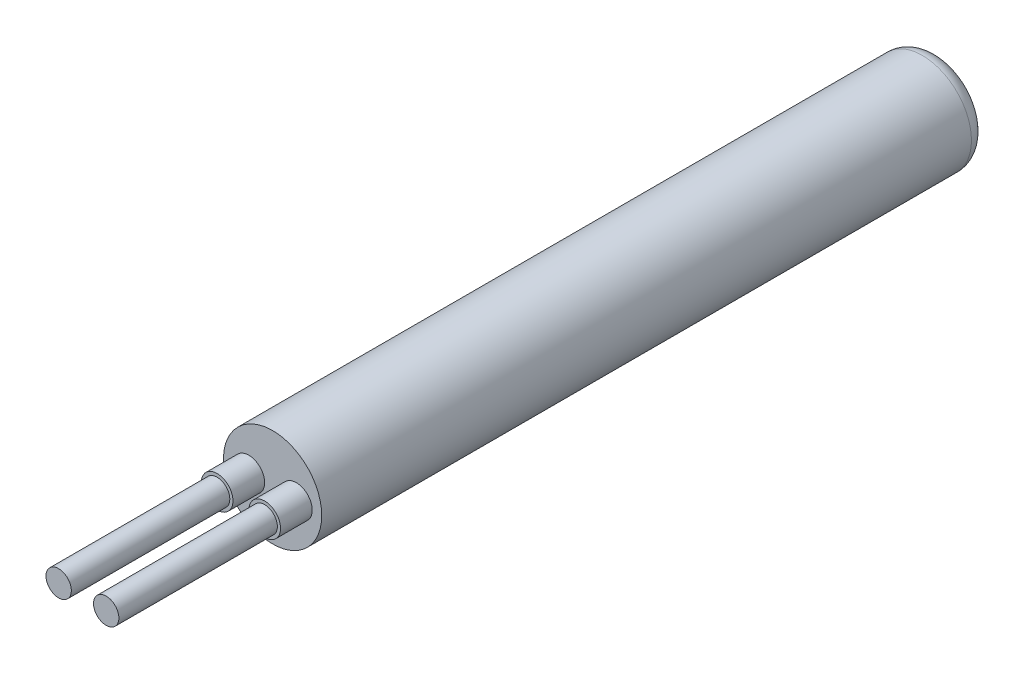
ISO-10303-21;
HEADER;
FILE_DESCRIPTION(('STEP AP214'),'2;1');
FILE_NAME('part.step','',(''),(''),'','','');
FILE_SCHEMA(('AUTOMOTIVE_DESIGN { 1 0 10303 214 1 1 1 1 }'));
ENDSEC;
DATA;
#1=APPLICATION_CONTEXT('core data for automotive mechanical design processes');
#2=APPLICATION_PROTOCOL_DEFINITION('international standard','automotive_design',2000,#1);
#3=PRODUCT_CONTEXT('',#1,'mechanical');
#4=PRODUCT('Part','Part','',(#3));
#5=PRODUCT_RELATED_PRODUCT_CATEGORY('part','',(#4));
#6=PRODUCT_DEFINITION_FORMATION('','',#4);
#7=PRODUCT_DEFINITION_CONTEXT('part definition',#1,'design');
#8=PRODUCT_DEFINITION('design','',#6,#7);
#9=PRODUCT_DEFINITION_SHAPE('','',#8);
#10=(LENGTH_UNIT() NAMED_UNIT(*) SI_UNIT(.MILLI.,.METRE.));
#11=(NAMED_UNIT(*) PLANE_ANGLE_UNIT() SI_UNIT($,.RADIAN.));
#12=(NAMED_UNIT(*) SI_UNIT($,.STERADIAN.) SOLID_ANGLE_UNIT());
#13=UNCERTAINTY_MEASURE_WITH_UNIT(LENGTH_MEASURE(1.E-05),#10,'distance_accuracy_value','');
#14=(GEOMETRIC_REPRESENTATION_CONTEXT(3) GLOBAL_UNCERTAINTY_ASSIGNED_CONTEXT((#13)) GLOBAL_UNIT_ASSIGNED_CONTEXT((#10,
#11,#12)) REPRESENTATION_CONTEXT('',''));
#15=CARTESIAN_POINT('',(0.,0.,0.));
#16=DIRECTION('',(0.,0.,1.));
#17=DIRECTION('',(1.,0.,0.));
#18=AXIS2_PLACEMENT_3D('',#15,#16,#17);
#19=CARTESIAN_POINT('',(0.,0.,21.));
#20=DIRECTION('',(0.,0.,1.));
#21=DIRECTION('',(1.,0.,0.));
#22=AXIS2_PLACEMENT_3D('',#19,#20,#21);
#23=PLANE('',#22);
#24=CARTESIAN_POINT('',(-0.75,0.,21.));
#25=DIRECTION('',(0.,0.,1.));
#26=DIRECTION('',(1.,0.,0.));
#27=AXIS2_PLACEMENT_3D('',#24,#25,#26);
#28=CIRCLE('',#27,0.5);
#29=CARTESIAN_POINT('',(-0.25,0.,21.));
#30=VERTEX_POINT('',#29);
#31=EDGE_CURVE('E54',#30,#30,#28,.T.);
#32=ORIENTED_EDGE('',*,*,#31,.F.);
#33=EDGE_LOOP('',(#32));
#34=FACE_BOUND('',#33,.T.);
#35=CARTESIAN_POINT('',(0.,0.,21.));
#36=DIRECTION('',(0.,0.,1.));
#37=DIRECTION('',(1.,0.,0.));
#38=AXIS2_PLACEMENT_3D('',#35,#36,#37);
#39=CIRCLE('',#38,1.55);
#40=CARTESIAN_POINT('',(1.55,0.,21.));
#41=VERTEX_POINT('',#40);
#42=EDGE_CURVE('E41',#41,#41,#39,.T.);
#43=ORIENTED_EDGE('',*,*,#42,.T.);
#44=EDGE_LOOP('',(#43));
#45=FACE_BOUND('',#44,.T.);
#46=CARTESIAN_POINT('',(0.75,0.,21.));
#47=DIRECTION('',(0.,0.,1.));
#48=DIRECTION('',(1.,0.,0.));
#49=AXIS2_PLACEMENT_3D('',#46,#47,#48);
#50=CIRCLE('',#49,0.5);
#51=CARTESIAN_POINT('',(1.25,0.,21.));
#52=VERTEX_POINT('',#51);
#53=EDGE_CURVE('E63',#52,#52,#50,.T.);
#54=ORIENTED_EDGE('',*,*,#53,.F.);
#55=EDGE_LOOP('',(#54));
#56=FACE_BOUND('',#55,.T.);
#57=ADVANCED_FACE('F30',(#34,#45,#56),#23,.T.);
#58=CARTESIAN_POINT('',(0.,0.,21.));
#59=DIRECTION('',(0.,0.,-1.));
#60=DIRECTION('',(-1.,0.,0.));
#61=AXIS2_PLACEMENT_3D('',#58,#59,#60);
#62=CYLINDRICAL_SURFACE('',#61,1.55);
#63=CARTESIAN_POINT('',(0.,0.,0.499999999999997));
#64=DIRECTION('',(0.,0.,1.));
#65=DIRECTION('',(1.,0.,0.));
#66=AXIS2_PLACEMENT_3D('',#63,#64,#65);
#67=CIRCLE('',#66,1.55);
#68=CARTESIAN_POINT('',(1.55,0.,0.499999999999997));
#69=VERTEX_POINT('',#68);
#70=EDGE_CURVE('E37',#69,#69,#67,.T.);
#71=ORIENTED_EDGE('',*,*,#70,.T.);
#72=EDGE_LOOP('',(#71));
#73=FACE_BOUND('',#72,.T.);
#74=ORIENTED_EDGE('',*,*,#42,.F.);
#75=EDGE_LOOP('',(#74));
#76=FACE_BOUND('',#75,.T.);
#77=ADVANCED_FACE('F92',(#73,#76),#62,.T.);
#78=CARTESIAN_POINT('',(0.,0.,0.));
#79=DIRECTION('',(0.,0.,1.));
#80=DIRECTION('',(1.,0.,0.));
#81=AXIS2_PLACEMENT_3D('',#78,#79,#80);
#82=PLANE('',#81);
#83=CARTESIAN_POINT('',(0.,0.,0.));
#84=DIRECTION('',(0.,0.,1.));
#85=DIRECTION('',(1.,0.,0.));
#86=AXIS2_PLACEMENT_3D('',#83,#84,#85);
#87=CIRCLE('',#86,1.05);
#88=CARTESIAN_POINT('',(1.05,0.,0.));
#89=VERTEX_POINT('',#88);
#90=EDGE_CURVE('E10',#89,#89,#87,.F.);
#91=ORIENTED_EDGE('',*,*,#90,.T.);
#92=EDGE_LOOP('',(#91));
#93=FACE_BOUND('',#92,.T.);
#94=ADVANCED_FACE('F98',(#93),#82,.F.);
#95=CARTESIAN_POINT('',(-0.75,0.,22.));
#96=DIRECTION('',(0.,0.,1.));
#97=DIRECTION('',(1.,0.,0.));
#98=AXIS2_PLACEMENT_3D('',#95,#96,#97);
#99=PLANE('',#98);
#100=CARTESIAN_POINT('',(-0.75,0.,22.));
#101=DIRECTION('',(0.,0.,1.));
#102=DIRECTION('',(1.,0.,0.));
#103=AXIS2_PLACEMENT_3D('',#100,#101,#102);
#104=CIRCLE('',#103,0.5);
#105=CARTESIAN_POINT('',(-0.25,0.,22.));
#106=VERTEX_POINT('',#105);
#107=EDGE_CURVE('E53',#106,#106,#104,.T.);
#108=ORIENTED_EDGE('',*,*,#107,.T.);
#109=EDGE_LOOP('',(#108));
#110=FACE_BOUND('',#109,.T.);
#111=CARTESIAN_POINT('',(-0.75,0.,22.));
#112=DIRECTION('',(0.,0.,1.));
#113=DIRECTION('',(1.,0.,0.));
#114=AXIS2_PLACEMENT_3D('',#111,#112,#113);
#115=CIRCLE('',#114,0.4);
#116=CARTESIAN_POINT('',(-0.35,0.,22.));
#117=VERTEX_POINT('',#116);
#118=EDGE_CURVE('E57',#117,#117,#115,.T.);
#119=ORIENTED_EDGE('',*,*,#118,.F.);
#120=EDGE_LOOP('',(#119));
#121=FACE_BOUND('',#120,.T.);
#122=ADVANCED_FACE('F105',(#110,#121),#99,.T.);
#123=CARTESIAN_POINT('',(-0.75,0.,22.));
#124=DIRECTION('',(0.,0.,-1.));
#125=DIRECTION('',(-1.,0.,0.));
#126=AXIS2_PLACEMENT_3D('',#123,#124,#125);
#127=CYLINDRICAL_SURFACE('',#126,0.5);
#128=ORIENTED_EDGE('',*,*,#107,.F.);
#129=EDGE_LOOP('',(#128));
#130=FACE_BOUND('',#129,.T.);
#131=ORIENTED_EDGE('',*,*,#31,.T.);
#132=EDGE_LOOP('',(#131));
#133=FACE_BOUND('',#132,.T.);
#134=ADVANCED_FACE('F109',(#130,#133),#127,.T.);
#135=CARTESIAN_POINT('',(-0.75,0.,27.));
#136=DIRECTION('',(0.,0.,1.));
#137=DIRECTION('',(1.,0.,0.));
#138=AXIS2_PLACEMENT_3D('',#135,#136,#137);
#139=PLANE('',#138);
#140=CARTESIAN_POINT('',(-0.75,0.,27.));
#141=DIRECTION('',(0.,0.,1.));
#142=DIRECTION('',(1.,0.,0.));
#143=AXIS2_PLACEMENT_3D('',#140,#141,#142);
#144=CIRCLE('',#143,0.4);
#145=CARTESIAN_POINT('',(-0.35,0.,27.));
#146=VERTEX_POINT('',#145);
#147=EDGE_CURVE('E50',#146,#146,#144,.T.);
#148=ORIENTED_EDGE('',*,*,#147,.T.);
#149=EDGE_LOOP('',(#148));
#150=FACE_BOUND('',#149,.T.);
#151=ADVANCED_FACE('F88',(#150),#139,.T.);
#152=CARTESIAN_POINT('',(-0.75,0.,27.));
#153=DIRECTION('',(0.,0.,-1.));
#154=DIRECTION('',(-1.,0.,0.));
#155=AXIS2_PLACEMENT_3D('',#152,#153,#154);
#156=CYLINDRICAL_SURFACE('',#155,0.4);
#157=ORIENTED_EDGE('',*,*,#118,.T.);
#158=EDGE_LOOP('',(#157));
#159=FACE_BOUND('',#158,.T.);
#160=ORIENTED_EDGE('',*,*,#147,.F.);
#161=EDGE_LOOP('',(#160));
#162=FACE_BOUND('',#161,.T.);
#163=ADVANCED_FACE('F78',(#159,#162),#156,.T.);
#164=CARTESIAN_POINT('',(0.75,0.,22.));
#165=DIRECTION('',(0.,0.,1.));
#166=DIRECTION('',(1.,0.,0.));
#167=AXIS2_PLACEMENT_3D('',#164,#165,#166);
#168=PLANE('',#167);
#169=CARTESIAN_POINT('',(0.75,0.,22.));
#170=DIRECTION('',(0.,0.,1.));
#171=DIRECTION('',(1.,0.,0.));
#172=AXIS2_PLACEMENT_3D('',#169,#170,#171);
#173=CIRCLE('',#172,0.5);
#174=CARTESIAN_POINT('',(1.25,0.,22.));
#175=VERTEX_POINT('',#174);
#176=EDGE_CURVE('E62',#175,#175,#173,.T.);
#177=ORIENTED_EDGE('',*,*,#176,.T.);
#178=EDGE_LOOP('',(#177));
#179=FACE_BOUND('',#178,.T.);
#180=CARTESIAN_POINT('',(0.75,0.,22.));
#181=DIRECTION('',(0.,0.,1.));
#182=DIRECTION('',(1.,0.,0.));
#183=AXIS2_PLACEMENT_3D('',#180,#181,#182);
#184=CIRCLE('',#183,0.4);
#185=CARTESIAN_POINT('',(1.15,0.,22.));
#186=VERTEX_POINT('',#185);
#187=EDGE_CURVE('E66',#186,#186,#184,.T.);
#188=ORIENTED_EDGE('',*,*,#187,.F.);
#189=EDGE_LOOP('',(#188));
#190=FACE_BOUND('',#189,.T.);
#191=ADVANCED_FACE('F75',(#179,#190),#168,.T.);
#192=CARTESIAN_POINT('',(0.75,0.,22.));
#193=DIRECTION('',(0.,0.,-1.));
#194=DIRECTION('',(-1.,0.,0.));
#195=AXIS2_PLACEMENT_3D('',#192,#193,#194);
#196=CYLINDRICAL_SURFACE('',#195,0.5);
#197=ORIENTED_EDGE('',*,*,#176,.F.);
#198=EDGE_LOOP('',(#197));
#199=FACE_BOUND('',#198,.T.);
#200=ORIENTED_EDGE('',*,*,#53,.T.);
#201=EDGE_LOOP('',(#200));
#202=FACE_BOUND('',#201,.T.);
#203=ADVANCED_FACE('F77',(#199,#202),#196,.T.);
#204=CARTESIAN_POINT('',(0.75,0.,27.));
#205=DIRECTION('',(0.,0.,1.));
#206=DIRECTION('',(1.,0.,0.));
#207=AXIS2_PLACEMENT_3D('',#204,#205,#206);
#208=PLANE('',#207);
#209=CARTESIAN_POINT('',(0.75,0.,27.));
#210=DIRECTION('',(0.,0.,1.));
#211=DIRECTION('',(1.,0.,0.));
#212=AXIS2_PLACEMENT_3D('',#209,#210,#211);
#213=CIRCLE('',#212,0.4);
#214=CARTESIAN_POINT('',(1.15,0.,27.));
#215=VERTEX_POINT('',#214);
#216=EDGE_CURVE('E45',#215,#215,#213,.T.);
#217=ORIENTED_EDGE('',*,*,#216,.T.);
#218=EDGE_LOOP('',(#217));
#219=FACE_BOUND('',#218,.T.);
#220=ADVANCED_FACE('F85',(#219),#208,.T.);
#221=CARTESIAN_POINT('',(0.75,0.,27.));
#222=DIRECTION('',(0.,0.,-1.));
#223=DIRECTION('',(-1.,0.,0.));
#224=AXIS2_PLACEMENT_3D('',#221,#222,#223);
#225=CYLINDRICAL_SURFACE('',#224,0.4);
#226=ORIENTED_EDGE('',*,*,#187,.T.);
#227=EDGE_LOOP('',(#226));
#228=FACE_BOUND('',#227,.T.);
#229=ORIENTED_EDGE('',*,*,#216,.F.);
#230=EDGE_LOOP('',(#229));
#231=FACE_BOUND('',#230,.T.);
#232=ADVANCED_FACE('F72',(#228,#231),#225,.T.);
#233=CARTESIAN_POINT('',(0.,0.,0.5));
#234=DIRECTION('',(0.,0.,1.));
#235=DIRECTION('',(1.,0.,0.));
#236=AXIS2_PLACEMENT_3D('',#233,#234,#235);
#237=TOROIDAL_SURFACE('',#236,1.05,0.5);
#238=ORIENTED_EDGE('',*,*,#90,.F.);
#239=EDGE_LOOP('',(#238));
#240=FACE_BOUND('',#239,.T.);
#241=ORIENTED_EDGE('',*,*,#70,.F.);
#242=EDGE_LOOP('',(#241));
#243=FACE_BOUND('',#242,.T.);
#244=ADVANCED_FACE('F32',(#240,#243),#237,.T.);
#245=CLOSED_SHELL('',(#57,#77,#94,#122,#134,#151,#163,#191,#203,#220,#232,#244));
#246=MANIFOLD_SOLID_BREP('B2',#245);
#247=ADVANCED_BREP_SHAPE_REPRESENTATION('',(#18,#246),#14);
#248=SHAPE_DEFINITION_REPRESENTATION(#9,#247);
ENDSEC;
END-ISO-10303-21;
